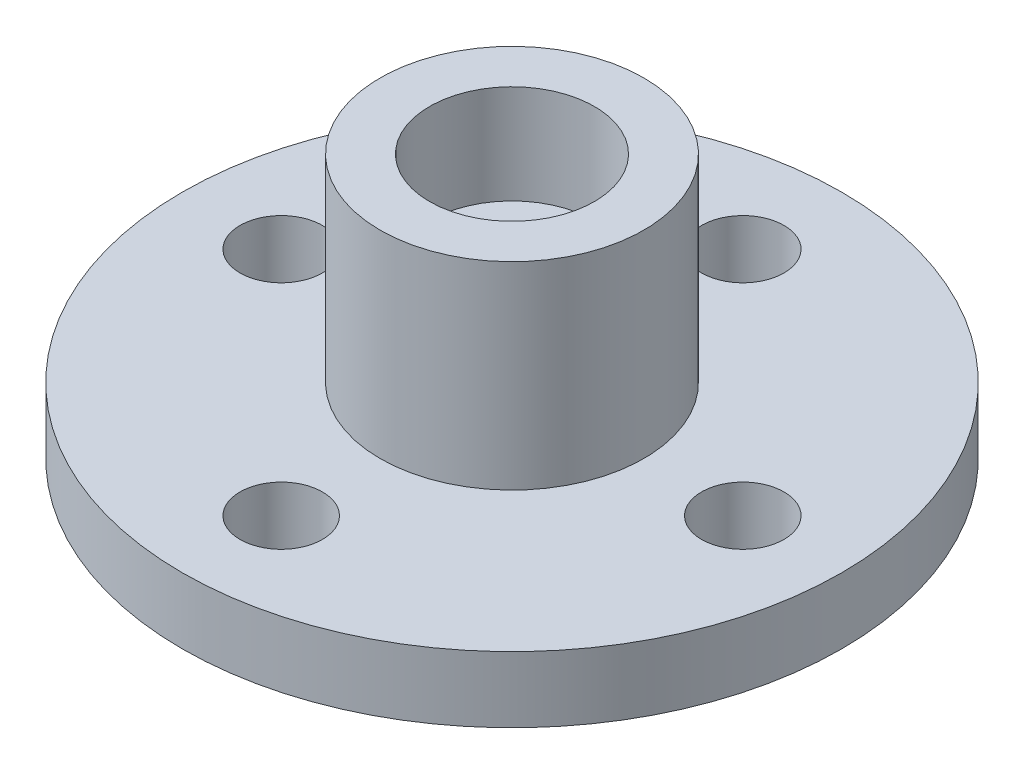
ISO-10303-21;
HEADER;
FILE_DESCRIPTION(('STEP AP214'),'2;1');
FILE_NAME('part.step','',(''),(''),'','','');
FILE_SCHEMA(('AUTOMOTIVE_DESIGN { 1 0 10303 214 1 1 1 1 }'));
ENDSEC;
DATA;
#1=APPLICATION_CONTEXT('core data for automotive mechanical design processes');
#2=APPLICATION_PROTOCOL_DEFINITION('international standard','automotive_design',2000,#1);
#3=PRODUCT_CONTEXT('',#1,'mechanical');
#4=PRODUCT('Part','Part','',(#3));
#5=PRODUCT_RELATED_PRODUCT_CATEGORY('part','',(#4));
#6=PRODUCT_DEFINITION_FORMATION('','',#4);
#7=PRODUCT_DEFINITION_CONTEXT('part definition',#1,'design');
#8=PRODUCT_DEFINITION('design','',#6,#7);
#9=PRODUCT_DEFINITION_SHAPE('','',#8);
#10=(LENGTH_UNIT() NAMED_UNIT(*) SI_UNIT(.MILLI.,.METRE.));
#11=(NAMED_UNIT(*) PLANE_ANGLE_UNIT() SI_UNIT($,.RADIAN.));
#12=(NAMED_UNIT(*) SI_UNIT($,.STERADIAN.) SOLID_ANGLE_UNIT());
#13=UNCERTAINTY_MEASURE_WITH_UNIT(LENGTH_MEASURE(1.E-05),#10,'distance_accuracy_value','');
#14=(GEOMETRIC_REPRESENTATION_CONTEXT(3) GLOBAL_UNCERTAINTY_ASSIGNED_CONTEXT((#13)) GLOBAL_UNIT_ASSIGNED_CONTEXT((#10,
#11,#12)) REPRESENTATION_CONTEXT('',''));
#15=CARTESIAN_POINT('',(0.,0.,0.));
#16=DIRECTION('',(0.,0.,1.));
#17=DIRECTION('',(1.,0.,0.));
#18=AXIS2_PLACEMENT_3D('',#15,#16,#17);
#19=CARTESIAN_POINT('',(0.,2.,0.));
#20=DIRECTION('',(0.,-1.,0.));
#21=DIRECTION('',(0.,0.,-1.));
#22=AXIS2_PLACEMENT_3D('',#19,#20,#21);
#23=CYLINDRICAL_SURFACE('',#22,10.);
#24=CARTESIAN_POINT('',(0.,2.,0.));
#25=DIRECTION('',(0.,1.,0.));
#26=DIRECTION('',(0.,0.,1.));
#27=AXIS2_PLACEMENT_3D('',#24,#25,#26);
#28=CIRCLE('',#27,10.);
#29=CARTESIAN_POINT('',(0.,2.,10.));
#30=VERTEX_POINT('',#29);
#31=EDGE_CURVE('E10',#30,#30,#28,.T.);
#32=ORIENTED_EDGE('',*,*,#31,.F.);
#33=EDGE_LOOP('',(#32));
#34=FACE_BOUND('',#33,.T.);
#35=CARTESIAN_POINT('',(0.,0.,0.));
#36=DIRECTION('',(0.,1.,0.));
#37=DIRECTION('',(0.,0.,1.));
#38=AXIS2_PLACEMENT_3D('',#35,#36,#37);
#39=CIRCLE('',#38,10.);
#40=CARTESIAN_POINT('',(0.,0.,10.));
#41=VERTEX_POINT('',#40);
#42=EDGE_CURVE('E37',#41,#41,#39,.T.);
#43=ORIENTED_EDGE('',*,*,#42,.T.);
#44=EDGE_LOOP('',(#43));
#45=FACE_BOUND('',#44,.T.);
#46=ADVANCED_FACE('F30',(#34,#45),#23,.T.);
#47=CARTESIAN_POINT('',(0.,2.,0.));
#48=DIRECTION('',(0.,1.,0.));
#49=DIRECTION('',(0.,0.,1.));
#50=AXIS2_PLACEMENT_3D('',#47,#48,#49);
#51=PLANE('',#50);
#52=CARTESIAN_POINT('',(0.,2.,0.));
#53=DIRECTION('',(0.,1.,0.));
#54=DIRECTION('',(0.,0.,1.));
#55=AXIS2_PLACEMENT_3D('',#52,#53,#54);
#56=CIRCLE('',#55,4.);
#57=CARTESIAN_POINT('',(0.,2.,4.));
#58=VERTEX_POINT('',#57);
#59=EDGE_CURVE('E65',#58,#58,#56,.T.);
#60=ORIENTED_EDGE('',*,*,#59,.F.);
#61=EDGE_LOOP('',(#60));
#62=FACE_BOUND('',#61,.T.);
#63=CARTESIAN_POINT('',(0.,2.,-7.));
#64=DIRECTION('',(0.,1.,0.));
#65=DIRECTION('',(0.,0.,1.));
#66=AXIS2_PLACEMENT_3D('',#63,#64,#65);
#67=CIRCLE('',#66,1.25);
#68=CARTESIAN_POINT('',(0.,2.,-5.75000000000001));
#69=VERTEX_POINT('',#68);
#70=EDGE_CURVE('E61',#69,#69,#67,.T.);
#71=ORIENTED_EDGE('',*,*,#70,.F.);
#72=EDGE_LOOP('',(#71));
#73=FACE_BOUND('',#72,.T.);
#74=CARTESIAN_POINT('',(-7.,2.,0.));
#75=DIRECTION('',(0.,1.,0.));
#76=DIRECTION('',(0.,0.,1.));
#77=AXIS2_PLACEMENT_3D('',#74,#75,#76);
#78=CIRCLE('',#77,1.25);
#79=CARTESIAN_POINT('',(-7.,2.,1.25));
#80=VERTEX_POINT('',#79);
#81=EDGE_CURVE('E55',#80,#80,#78,.T.);
#82=ORIENTED_EDGE('',*,*,#81,.F.);
#83=EDGE_LOOP('',(#82));
#84=FACE_BOUND('',#83,.T.);
#85=CARTESIAN_POINT('',(0.,2.,7.));
#86=DIRECTION('',(0.,1.,0.));
#87=DIRECTION('',(0.,0.,1.));
#88=AXIS2_PLACEMENT_3D('',#85,#86,#87);
#89=CIRCLE('',#88,1.25);
#90=CARTESIAN_POINT('',(0.,2.,8.24999999999999));
#91=VERTEX_POINT('',#90);
#92=EDGE_CURVE('E49',#91,#91,#89,.T.);
#93=ORIENTED_EDGE('',*,*,#92,.F.);
#94=EDGE_LOOP('',(#93));
#95=FACE_BOUND('',#94,.T.);
#96=CARTESIAN_POINT('',(7.,2.,0.));
#97=DIRECTION('',(0.,1.,0.));
#98=DIRECTION('',(0.,0.,1.));
#99=AXIS2_PLACEMENT_3D('',#96,#97,#98);
#100=CIRCLE('',#99,1.25);
#101=CARTESIAN_POINT('',(7.,2.,1.25));
#102=VERTEX_POINT('',#101);
#103=EDGE_CURVE('E46',#102,#102,#100,.T.);
#104=ORIENTED_EDGE('',*,*,#103,.F.);
#105=EDGE_LOOP('',(#104));
#106=FACE_BOUND('',#105,.T.);
#107=ORIENTED_EDGE('',*,*,#31,.T.);
#108=EDGE_LOOP('',(#107));
#109=FACE_BOUND('',#108,.T.);
#110=ADVANCED_FACE('F111',(#62,#73,#84,#95,#106,#109),#51,.T.);
#111=CARTESIAN_POINT('',(0.,0.,0.));
#112=DIRECTION('',(0.,1.,0.));
#113=DIRECTION('',(0.,0.,1.));
#114=AXIS2_PLACEMENT_3D('',#111,#112,#113);
#115=PLANE('',#114);
#116=CARTESIAN_POINT('',(0.,0.,0.));
#117=DIRECTION('',(0.,1.,0.));
#118=DIRECTION('',(0.,0.,1.));
#119=AXIS2_PLACEMENT_3D('',#116,#117,#118);
#120=CIRCLE('',#119,1.24999999999999);
#121=CARTESIAN_POINT('',(0.,0.,1.24999999999999));
#122=VERTEX_POINT('',#121);
#123=EDGE_CURVE('E74',#122,#122,#120,.T.);
#124=ORIENTED_EDGE('',*,*,#123,.T.);
#125=EDGE_LOOP('',(#124));
#126=FACE_BOUND('',#125,.T.);
#127=CARTESIAN_POINT('',(0.,0.,-7.));
#128=DIRECTION('',(0.,1.,0.));
#129=DIRECTION('',(0.,0.,1.));
#130=AXIS2_PLACEMENT_3D('',#127,#128,#129);
#131=CIRCLE('',#130,1.24999999999999);
#132=CARTESIAN_POINT('',(0.,0.,-5.75000000000001));
#133=VERTEX_POINT('',#132);
#134=EDGE_CURVE('E58',#133,#133,#131,.T.);
#135=ORIENTED_EDGE('',*,*,#134,.T.);
#136=EDGE_LOOP('',(#135));
#137=FACE_BOUND('',#136,.T.);
#138=CARTESIAN_POINT('',(-7.,0.,0.));
#139=DIRECTION('',(0.,1.,0.));
#140=DIRECTION('',(0.,0.,1.));
#141=AXIS2_PLACEMENT_3D('',#138,#139,#140);
#142=CIRCLE('',#141,1.24999999999999);
#143=CARTESIAN_POINT('',(-7.,0.,1.24999999999999));
#144=VERTEX_POINT('',#143);
#145=EDGE_CURVE('E52',#144,#144,#142,.T.);
#146=ORIENTED_EDGE('',*,*,#145,.T.);
#147=EDGE_LOOP('',(#146));
#148=FACE_BOUND('',#147,.T.);
#149=CARTESIAN_POINT('',(0.,0.,7.));
#150=DIRECTION('',(0.,1.,0.));
#151=DIRECTION('',(0.,0.,1.));
#152=AXIS2_PLACEMENT_3D('',#149,#150,#151);
#153=CIRCLE('',#152,1.24999999999999);
#154=CARTESIAN_POINT('',(0.,0.,8.24999999999999));
#155=VERTEX_POINT('',#154);
#156=EDGE_CURVE('E33',#155,#155,#153,.T.);
#157=ORIENTED_EDGE('',*,*,#156,.T.);
#158=EDGE_LOOP('',(#157));
#159=FACE_BOUND('',#158,.T.);
#160=CARTESIAN_POINT('',(7.,0.,0.));
#161=DIRECTION('',(0.,1.,0.));
#162=DIRECTION('',(0.,0.,1.));
#163=AXIS2_PLACEMENT_3D('',#160,#161,#162);
#164=CIRCLE('',#163,1.24999999999999);
#165=CARTESIAN_POINT('',(7.,0.,1.24999999999999));
#166=VERTEX_POINT('',#165);
#167=EDGE_CURVE('E42',#166,#166,#164,.T.);
#168=ORIENTED_EDGE('',*,*,#167,.T.);
#169=EDGE_LOOP('',(#168));
#170=FACE_BOUND('',#169,.T.);
#171=ORIENTED_EDGE('',*,*,#42,.F.);
#172=EDGE_LOOP('',(#171));
#173=FACE_BOUND('',#172,.T.);
#174=ADVANCED_FACE('F114',(#126,#137,#148,#159,#170,#173),#115,.F.);
#175=CARTESIAN_POINT('',(7.,2.,0.));
#176=DIRECTION('',(0.,1.,0.));
#177=DIRECTION('',(0.,0.,1.));
#178=AXIS2_PLACEMENT_3D('',#175,#176,#177);
#179=CYLINDRICAL_SURFACE('',#178,1.24999999999999);
#180=ORIENTED_EDGE('',*,*,#103,.T.);
#181=EDGE_LOOP('',(#180));
#182=FACE_BOUND('',#181,.T.);
#183=ORIENTED_EDGE('',*,*,#167,.F.);
#184=EDGE_LOOP('',(#183));
#185=FACE_BOUND('',#184,.T.);
#186=ADVANCED_FACE('F124',(#182,#185),#179,.F.);
#187=CARTESIAN_POINT('',(0.,2.,7.));
#188=DIRECTION('',(0.,1.,0.));
#189=DIRECTION('',(0.,0.,1.));
#190=AXIS2_PLACEMENT_3D('',#187,#188,#189);
#191=CYLINDRICAL_SURFACE('',#190,1.24999999999999);
#192=ORIENTED_EDGE('',*,*,#92,.T.);
#193=EDGE_LOOP('',(#192));
#194=FACE_BOUND('',#193,.T.);
#195=ORIENTED_EDGE('',*,*,#156,.F.);
#196=EDGE_LOOP('',(#195));
#197=FACE_BOUND('',#196,.T.);
#198=ADVANCED_FACE('F127',(#194,#197),#191,.F.);
#199=CARTESIAN_POINT('',(-7.,2.,0.));
#200=DIRECTION('',(0.,1.,0.));
#201=DIRECTION('',(0.,0.,1.));
#202=AXIS2_PLACEMENT_3D('',#199,#200,#201);
#203=CYLINDRICAL_SURFACE('',#202,1.24999999999999);
#204=ORIENTED_EDGE('',*,*,#81,.T.);
#205=EDGE_LOOP('',(#204));
#206=FACE_BOUND('',#205,.T.);
#207=ORIENTED_EDGE('',*,*,#145,.F.);
#208=EDGE_LOOP('',(#207));
#209=FACE_BOUND('',#208,.T.);
#210=ADVANCED_FACE('F162',(#206,#209),#203,.F.);
#211=CARTESIAN_POINT('',(0.,2.,-7.));
#212=DIRECTION('',(0.,1.,0.));
#213=DIRECTION('',(0.,0.,1.));
#214=AXIS2_PLACEMENT_3D('',#211,#212,#213);
#215=CYLINDRICAL_SURFACE('',#214,1.24999999999999);
#216=ORIENTED_EDGE('',*,*,#70,.T.);
#217=EDGE_LOOP('',(#216));
#218=FACE_BOUND('',#217,.T.);
#219=ORIENTED_EDGE('',*,*,#134,.F.);
#220=EDGE_LOOP('',(#219));
#221=FACE_BOUND('',#220,.T.);
#222=ADVANCED_FACE('F107',(#218,#221),#215,.F.);
#223=CARTESIAN_POINT('',(0.,8.,0.));
#224=DIRECTION('',(0.,-1.,0.));
#225=DIRECTION('',(0.,0.,-1.));
#226=AXIS2_PLACEMENT_3D('',#223,#224,#225);
#227=CYLINDRICAL_SURFACE('',#226,4.);
#228=CARTESIAN_POINT('',(0.,8.,0.));
#229=DIRECTION('',(0.,1.,0.));
#230=DIRECTION('',(0.,0.,1.));
#231=AXIS2_PLACEMENT_3D('',#228,#229,#230);
#232=CIRCLE('',#231,4.);
#233=CARTESIAN_POINT('',(0.,8.,4.));
#234=VERTEX_POINT('',#233);
#235=EDGE_CURVE('E64',#234,#234,#232,.T.);
#236=ORIENTED_EDGE('',*,*,#235,.F.);
#237=EDGE_LOOP('',(#236));
#238=FACE_BOUND('',#237,.T.);
#239=ORIENTED_EDGE('',*,*,#59,.T.);
#240=EDGE_LOOP('',(#239));
#241=FACE_BOUND('',#240,.T.);
#242=ADVANCED_FACE('F101',(#238,#241),#227,.T.);
#243=CARTESIAN_POINT('',(0.,8.,0.));
#244=DIRECTION('',(0.,1.,0.));
#245=DIRECTION('',(0.,0.,1.));
#246=AXIS2_PLACEMENT_3D('',#243,#244,#245);
#247=PLANE('',#246);
#248=CARTESIAN_POINT('',(0.,8.,0.));
#249=DIRECTION('',(0.,1.,0.));
#250=DIRECTION('',(0.,0.,1.));
#251=AXIS2_PLACEMENT_3D('',#248,#249,#250);
#252=CIRCLE('',#251,2.5);
#253=CARTESIAN_POINT('',(0.,8.,2.5));
#254=VERTEX_POINT('',#253);
#255=EDGE_CURVE('E71',#254,#254,#252,.T.);
#256=ORIENTED_EDGE('',*,*,#255,.F.);
#257=EDGE_LOOP('',(#256));
#258=FACE_BOUND('',#257,.T.);
#259=ORIENTED_EDGE('',*,*,#235,.T.);
#260=EDGE_LOOP('',(#259));
#261=FACE_BOUND('',#260,.T.);
#262=ADVANCED_FACE('F95',(#258,#261),#247,.T.);
#263=CARTESIAN_POINT('',(0.,5.,0.));
#264=DIRECTION('',(0.,1.,0.));
#265=DIRECTION('',(0.,0.,1.));
#266=AXIS2_PLACEMENT_3D('',#263,#264,#265);
#267=CYLINDRICAL_SURFACE('',#266,2.5);
#268=CARTESIAN_POINT('',(0.,5.,0.));
#269=DIRECTION('',(0.,1.,0.));
#270=DIRECTION('',(0.,0.,1.));
#271=AXIS2_PLACEMENT_3D('',#268,#269,#270);
#272=CIRCLE('',#271,2.5);
#273=CARTESIAN_POINT('',(0.,5.,2.5));
#274=VERTEX_POINT('',#273);
#275=EDGE_CURVE('E68',#274,#274,#272,.T.);
#276=ORIENTED_EDGE('',*,*,#275,.F.);
#277=EDGE_LOOP('',(#276));
#278=FACE_BOUND('',#277,.T.);
#279=ORIENTED_EDGE('',*,*,#255,.T.);
#280=EDGE_LOOP('',(#279));
#281=FACE_BOUND('',#280,.T.);
#282=ADVANCED_FACE('F89',(#278,#281),#267,.F.);
#283=CARTESIAN_POINT('',(0.,5.,0.));
#284=DIRECTION('',(0.,1.,0.));
#285=DIRECTION('',(0.,0.,1.));
#286=AXIS2_PLACEMENT_3D('',#283,#284,#285);
#287=PLANE('',#286);
#288=CARTESIAN_POINT('',(0.,5.,0.));
#289=DIRECTION('',(0.,1.,0.));
#290=DIRECTION('',(0.,0.,1.));
#291=AXIS2_PLACEMENT_3D('',#288,#289,#290);
#292=CIRCLE('',#291,1.24999999999999);
#293=CARTESIAN_POINT('',(0.,5.,1.24999999999999));
#294=VERTEX_POINT('',#293);
#295=EDGE_CURVE('E79',#294,#294,#292,.T.);
#296=ORIENTED_EDGE('',*,*,#295,.F.);
#297=EDGE_LOOP('',(#296));
#298=FACE_BOUND('',#297,.T.);
#299=ORIENTED_EDGE('',*,*,#275,.T.);
#300=EDGE_LOOP('',(#299));
#301=FACE_BOUND('',#300,.T.);
#302=ADVANCED_FACE('F86',(#298,#301),#287,.T.);
#303=CARTESIAN_POINT('',(0.,5.,0.));
#304=DIRECTION('',(0.,1.,0.));
#305=DIRECTION('',(0.,0.,1.));
#306=AXIS2_PLACEMENT_3D('',#303,#304,#305);
#307=CYLINDRICAL_SURFACE('',#306,1.24999999999999);
#308=ORIENTED_EDGE('',*,*,#295,.T.);
#309=EDGE_LOOP('',(#308));
#310=FACE_BOUND('',#309,.T.);
#311=ORIENTED_EDGE('',*,*,#123,.F.);
#312=EDGE_LOOP('',(#311));
#313=FACE_BOUND('',#312,.T.);
#314=ADVANCED_FACE('F83',(#310,#313),#307,.F.);
#315=CLOSED_SHELL('',(#46,#110,#174,#186,#198,#210,#222,#242,#262,#282,#302,#314));
#316=MANIFOLD_SOLID_BREP('B2',#315);
#317=ADVANCED_BREP_SHAPE_REPRESENTATION('',(#18,#316),#14);
#318=SHAPE_DEFINITION_REPRESENTATION(#9,#317);
ENDSEC;
END-ISO-10303-21;
